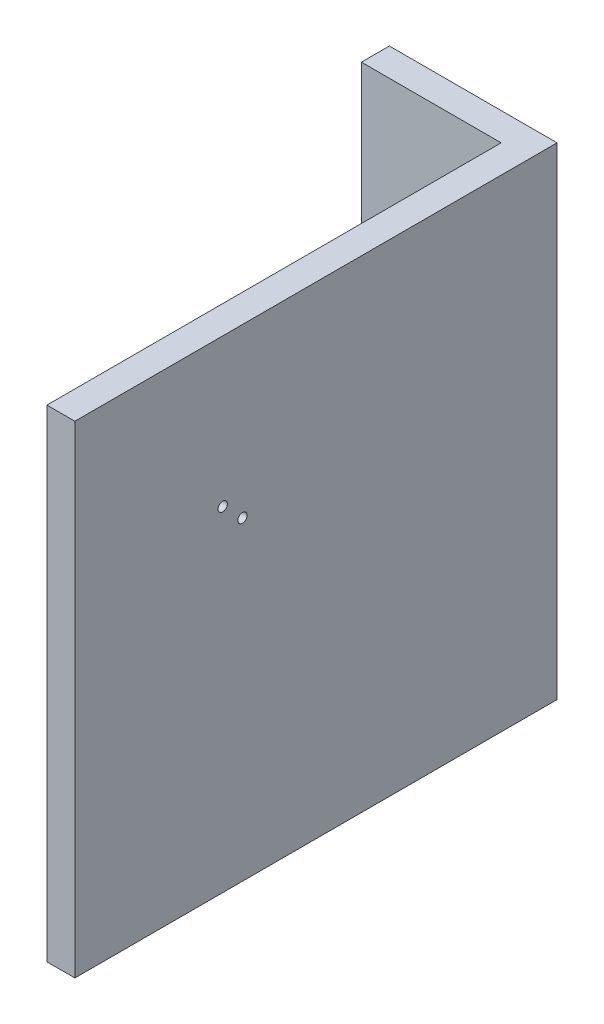
ISO-10303-21;
HEADER;
FILE_DESCRIPTION(('STEP AP214'),'2;1');
FILE_NAME('part.step','',(''),(''),'','','');
FILE_SCHEMA(('AUTOMOTIVE_DESIGN { 1 0 10303 214 1 1 1 1 }'));
ENDSEC;
DATA;
#1=APPLICATION_CONTEXT('core data for automotive mechanical design processes');
#2=APPLICATION_PROTOCOL_DEFINITION('international standard','automotive_design',2000,#1);
#3=PRODUCT_CONTEXT('',#1,'mechanical');
#4=PRODUCT('Part','Part','',(#3));
#5=PRODUCT_RELATED_PRODUCT_CATEGORY('part','',(#4));
#6=PRODUCT_DEFINITION_FORMATION('','',#4);
#7=PRODUCT_DEFINITION_CONTEXT('part definition',#1,'design');
#8=PRODUCT_DEFINITION('design','',#6,#7);
#9=PRODUCT_DEFINITION_SHAPE('','',#8);
#10=(LENGTH_UNIT() NAMED_UNIT(*) SI_UNIT(.MILLI.,.METRE.));
#11=(NAMED_UNIT(*) PLANE_ANGLE_UNIT() SI_UNIT($,.RADIAN.));
#12=(NAMED_UNIT(*) SI_UNIT($,.STERADIAN.) SOLID_ANGLE_UNIT());
#13=UNCERTAINTY_MEASURE_WITH_UNIT(LENGTH_MEASURE(1.E-05),#10,'distance_accuracy_value','');
#14=(GEOMETRIC_REPRESENTATION_CONTEXT(3) GLOBAL_UNCERTAINTY_ASSIGNED_CONTEXT((#13)) GLOBAL_UNIT_ASSIGNED_CONTEXT((#10,
#11,#12)) REPRESENTATION_CONTEXT('',''));
#15=CARTESIAN_POINT('',(0.,0.,0.));
#16=DIRECTION('',(0.,0.,1.));
#17=DIRECTION('',(1.,0.,0.));
#18=AXIS2_PLACEMENT_3D('',#15,#16,#17);
#19=CARTESIAN_POINT('',(-23118.612597115,0.,0.));
#20=DIRECTION('',(1.,0.,0.));
#21=DIRECTION('',(0.,0.,-1.));
#22=AXIS2_PLACEMENT_3D('',#19,#20,#21);
#23=PLANE('',#22);
#24=CARTESIAN_POINT('',(-23118.612597115,6904.39046850381,40831.9938961542));
#25=DIRECTION('',(-1.,0.,0.));
#26=DIRECTION('',(0.,0.,1.));
#27=AXIS2_PLACEMENT_3D('',#24,#25,#26);
#28=CIRCLE('',#27,3.34999999840949);
#29=CARTESIAN_POINT('',(-23118.612597115,6904.39046850381,40835.3438961526));
#30=VERTEX_POINT('',#29);
#31=EDGE_CURVE('E147',#30,#30,#28,.T.);
#32=ORIENTED_EDGE('',*,*,#31,.F.);
#33=EDGE_LOOP('',(#32));
#34=FACE_BOUND('',#33,.T.);
#35=CARTESIAN_POINT('',(-23118.612597115,6918.53260412754,40846.1360317779));
#36=DIRECTION('',(-1.,0.,0.));
#37=DIRECTION('',(0.,0.,1.));
#38=AXIS2_PLACEMENT_3D('',#35,#36,#37);
#39=CIRCLE('',#38,3.34999999840949);
#40=CARTESIAN_POINT('',(-23118.612597115,6918.53260412754,40849.4860317763));
#41=VERTEX_POINT('',#40);
#42=EDGE_CURVE('E104',#41,#41,#39,.T.);
#43=ORIENTED_EDGE('',*,*,#42,.F.);
#44=EDGE_LOOP('',(#43));
#45=FACE_BOUND('',#44,.T.);
#46=DIRECTION('',(0.,1.,0.));
#47=VECTOR('',#46,1.);
#48=CARTESIAN_POINT('',(-23118.612597115,7024.30157612939,40626.9075044839));
#49=LINE('',#48,#47);
#50=CARTESIAN_POINT('',(-23118.612597115,6679.30407683354,40626.9075044839));
#51=VERTEX_POINT('',#50);
#52=CARTESIAN_POINT('',(-23118.612597115,7024.30157612939,40626.9075044839));
#53=VERTEX_POINT('',#52);
#54=EDGE_CURVE('E54',#51,#53,#49,.T.);
#55=ORIENTED_EDGE('',*,*,#54,.F.);
#56=DIRECTION('',(0.,0.,1.));
#57=VECTOR('',#56,1.);
#58=CARTESIAN_POINT('',(-23118.612597115,6679.30407683354,40951.9050037798));
#59=LINE('',#58,#57);
#60=CARTESIAN_POINT('',(-23118.612597115,6679.30407683354,40951.9050037798));
#61=VERTEX_POINT('',#60);
#62=EDGE_CURVE('E59',#51,#61,#59,.T.);
#63=ORIENTED_EDGE('',*,*,#62,.T.);
#64=DIRECTION('',(0.,1.,0.));
#65=VECTOR('',#64,1.);
#66=CARTESIAN_POINT('',(-23118.612597115,7024.30157612939,40951.9050037798));
#67=LINE('',#66,#65);
#68=CARTESIAN_POINT('',(-23118.612597115,7024.30157612939,40951.9050037798));
#69=VERTEX_POINT('',#68);
#70=EDGE_CURVE('E90',#61,#69,#67,.T.);
#71=ORIENTED_EDGE('',*,*,#70,.T.);
#72=DIRECTION('',(0.,0.,-1.));
#73=VECTOR('',#72,1.);
#74=CARTESIAN_POINT('',(-23118.612597115,7024.30157612939,40951.9050037798));
#75=LINE('',#74,#73);
#76=EDGE_CURVE('E152',#69,#53,#75,.T.);
#77=ORIENTED_EDGE('',*,*,#76,.T.);
#78=EDGE_LOOP('',(#55,#63,#71,#77));
#79=FACE_BOUND('',#78,.T.);
#80=ADVANCED_FACE('F39',(#34,#45,#79),#23,.F.);
#81=CARTESIAN_POINT('',(-23118.612597115,7024.30157612939,40951.9050037798));
#82=DIRECTION('',(0.,0.,-1.));
#83=DIRECTION('',(-1.,0.,0.));
#84=AXIS2_PLACEMENT_3D('',#81,#82,#83);
#85=PLANE('',#84);
#86=DIRECTION('',(0.,1.,0.));
#87=VECTOR('',#86,1.);
#88=CARTESIAN_POINT('',(-23098.612597115,7024.30157612939,40951.9050037798));
#89=LINE('',#88,#87);
#90=CARTESIAN_POINT('',(-23098.612597115,6679.30407683354,40951.9050037798));
#91=VERTEX_POINT('',#90);
#92=CARTESIAN_POINT('',(-23098.612597115,7024.30157612939,40951.9050037798));
#93=VERTEX_POINT('',#92);
#94=EDGE_CURVE('E96',#91,#93,#89,.T.);
#95=ORIENTED_EDGE('',*,*,#94,.T.);
#96=DIRECTION('',(1.,0.,0.));
#97=VECTOR('',#96,1.);
#98=CARTESIAN_POINT('',(-23118.612597115,7024.30157612939,40951.9050037798));
#99=LINE('',#98,#97);
#100=EDGE_CURVE('E11',#69,#93,#99,.T.);
#101=ORIENTED_EDGE('',*,*,#100,.F.);
#102=ORIENTED_EDGE('',*,*,#70,.F.);
#103=DIRECTION('',(1.,0.,0.));
#104=VECTOR('',#103,1.);
#105=CARTESIAN_POINT('',(-23118.612597115,6679.30407683354,40951.9050037798));
#106=LINE('',#105,#104);
#107=EDGE_CURVE('E82',#61,#91,#106,.T.);
#108=ORIENTED_EDGE('',*,*,#107,.T.);
#109=EDGE_LOOP('',(#95,#101,#102,#108));
#110=FACE_BOUND('',#109,.T.);
#111=ADVANCED_FACE('F41',(#110),#85,.F.);
#112=CARTESIAN_POINT('',(-23118.612597115,7024.30157612939,40951.9050037798));
#113=DIRECTION('',(0.,-1.,0.));
#114=DIRECTION('',(1.,0.,0.));
#115=AXIS2_PLACEMENT_3D('',#112,#113,#114);
#116=PLANE('',#115);
#117=DIRECTION('',(0.,0.,-1.));
#118=VECTOR('',#117,1.);
#119=CARTESIAN_POINT('',(-23098.612597115,7024.30157612939,40951.9050037798));
#120=LINE('',#119,#118);
#121=CARTESIAN_POINT('',(-23098.612597115,7024.30157612939,40606.9075044839));
#122=VERTEX_POINT('',#121);
#123=EDGE_CURVE('E99',#93,#122,#120,.T.);
#124=ORIENTED_EDGE('',*,*,#123,.T.);
#125=DIRECTION('',(1.,0.,0.));
#126=VECTOR('',#125,1.);
#127=CARTESIAN_POINT('',(-23118.612597115,7024.30157612939,40606.9075044839));
#128=LINE('',#127,#126);
#129=CARTESIAN_POINT('',(-23218.612597115,7024.30157612939,40606.9075044839));
#130=VERTEX_POINT('',#129);
#131=EDGE_CURVE('E47',#130,#122,#128,.T.);
#132=ORIENTED_EDGE('',*,*,#131,.F.);
#133=DIRECTION('',(0.,0.,-1.));
#134=VECTOR('',#133,1.);
#135=CARTESIAN_POINT('',(-23218.612597115,7024.30157612939,40606.9075044839));
#136=LINE('',#135,#134);
#137=CARTESIAN_POINT('',(-23218.612597115,7024.30157612939,40626.9075044839));
#138=VERTEX_POINT('',#137);
#139=EDGE_CURVE('E123',#138,#130,#136,.T.);
#140=ORIENTED_EDGE('',*,*,#139,.F.);
#141=DIRECTION('',(1.,0.,0.));
#142=VECTOR('',#141,1.);
#143=CARTESIAN_POINT('',(-23218.612597115,7024.30157612939,40626.9075044839));
#144=LINE('',#143,#142);
#145=EDGE_CURVE('E133',#138,#53,#144,.T.);
#146=ORIENTED_EDGE('',*,*,#145,.T.);
#147=ORIENTED_EDGE('',*,*,#76,.F.);
#148=ORIENTED_EDGE('',*,*,#100,.T.);
#149=EDGE_LOOP('',(#124,#132,#140,#146,#147,#148));
#150=FACE_BOUND('',#149,.T.);
#151=ADVANCED_FACE('F120',(#150),#116,.F.);
#152=CARTESIAN_POINT('',(-23118.612597115,7024.30157612939,40606.9075044839));
#153=DIRECTION('',(0.,0.,1.));
#154=DIRECTION('',(1.,0.,0.));
#155=AXIS2_PLACEMENT_3D('',#152,#153,#154);
#156=PLANE('',#155);
#157=DIRECTION('',(0.,-1.,0.));
#158=VECTOR('',#157,1.);
#159=CARTESIAN_POINT('',(-23098.612597115,7024.30157612939,40606.9075044839));
#160=LINE('',#159,#158);
#161=CARTESIAN_POINT('',(-23098.612597115,6679.30407683354,40606.9075044839));
#162=VERTEX_POINT('',#161);
#163=EDGE_CURVE('E91',#122,#162,#160,.T.);
#164=ORIENTED_EDGE('',*,*,#163,.T.);
#165=DIRECTION('',(1.,0.,0.));
#166=VECTOR('',#165,1.);
#167=CARTESIAN_POINT('',(-23118.612597115,6679.30407683354,40606.9075044839));
#168=LINE('',#167,#166);
#169=CARTESIAN_POINT('',(-23218.612597115,6679.30407683354,40606.9075044839));
#170=VERTEX_POINT('',#169);
#171=EDGE_CURVE('E86',#170,#162,#168,.T.);
#172=ORIENTED_EDGE('',*,*,#171,.F.);
#173=DIRECTION('',(0.,-1.,0.));
#174=VECTOR('',#173,1.);
#175=CARTESIAN_POINT('',(-23218.612597115,7024.30157612939,40606.9075044839));
#176=LINE('',#175,#174);
#177=EDGE_CURVE('E116',#130,#170,#176,.T.);
#178=ORIENTED_EDGE('',*,*,#177,.F.);
#179=ORIENTED_EDGE('',*,*,#131,.T.);
#180=EDGE_LOOP('',(#164,#172,#178,#179));
#181=FACE_BOUND('',#180,.T.);
#182=ADVANCED_FACE('F114',(#181),#156,.F.);
#183=CARTESIAN_POINT('',(-23118.612597115,6679.30407683354,40951.9050037798));
#184=DIRECTION('',(0.,1.,0.));
#185=DIRECTION('',(-1.,0.,0.));
#186=AXIS2_PLACEMENT_3D('',#183,#184,#185);
#187=PLANE('',#186);
#188=DIRECTION('',(0.,0.,1.));
#189=VECTOR('',#188,1.);
#190=CARTESIAN_POINT('',(-23098.612597115,6679.30407683354,40951.9050037798));
#191=LINE('',#190,#189);
#192=EDGE_CURVE('E79',#162,#91,#191,.T.);
#193=ORIENTED_EDGE('',*,*,#192,.T.);
#194=ORIENTED_EDGE('',*,*,#107,.F.);
#195=ORIENTED_EDGE('',*,*,#62,.F.);
#196=DIRECTION('',(1.,0.,0.));
#197=VECTOR('',#196,1.);
#198=CARTESIAN_POINT('',(-23218.612597115,6679.30407683354,40626.9075044839));
#199=LINE('',#198,#197);
#200=CARTESIAN_POINT('',(-23218.612597115,6679.30407683354,40626.9075044839));
#201=VERTEX_POINT('',#200);
#202=EDGE_CURVE('E135',#201,#51,#199,.T.);
#203=ORIENTED_EDGE('',*,*,#202,.F.);
#204=DIRECTION('',(0.,0.,1.));
#205=VECTOR('',#204,1.);
#206=CARTESIAN_POINT('',(-23218.612597115,6679.30407683354,40606.9075044839));
#207=LINE('',#206,#205);
#208=EDGE_CURVE('E137',#170,#201,#207,.T.);
#209=ORIENTED_EDGE('',*,*,#208,.F.);
#210=ORIENTED_EDGE('',*,*,#171,.T.);
#211=EDGE_LOOP('',(#193,#194,#195,#203,#209,#210));
#212=FACE_BOUND('',#211,.T.);
#213=ADVANCED_FACE('F81',(#212),#187,.F.);
#214=CARTESIAN_POINT('',(-23098.612597115,0.,0.));
#215=DIRECTION('',(1.,0.,0.));
#216=DIRECTION('',(0.,0.,-1.));
#217=AXIS2_PLACEMENT_3D('',#214,#215,#216);
#218=PLANE('',#217);
#219=CARTESIAN_POINT('',(-23098.612597115,6918.53260412754,40846.1360317779));
#220=DIRECTION('',(-1.,0.,0.));
#221=DIRECTION('',(0.,0.,1.));
#222=AXIS2_PLACEMENT_3D('',#219,#220,#221);
#223=CIRCLE('',#222,3.34999999840949);
#224=CARTESIAN_POINT('',(-23098.612597115,6918.53260412754,40849.4860317763));
#225=VERTEX_POINT('',#224);
#226=EDGE_CURVE('E100',#225,#225,#223,.T.);
#227=ORIENTED_EDGE('',*,*,#226,.T.);
#228=EDGE_LOOP('',(#227));
#229=FACE_BOUND('',#228,.T.);
#230=CARTESIAN_POINT('',(-23098.612597115,6904.39046850381,40831.9938961542));
#231=DIRECTION('',(-1.,0.,0.));
#232=DIRECTION('',(0.,0.,1.));
#233=AXIS2_PLACEMENT_3D('',#230,#231,#232);
#234=CIRCLE('',#233,3.34999999840949);
#235=CARTESIAN_POINT('',(-23098.612597115,6904.39046850381,40835.3438961526));
#236=VERTEX_POINT('',#235);
#237=EDGE_CURVE('E143',#236,#236,#234,.T.);
#238=ORIENTED_EDGE('',*,*,#237,.T.);
#239=EDGE_LOOP('',(#238));
#240=FACE_BOUND('',#239,.T.);
#241=ORIENTED_EDGE('',*,*,#94,.F.);
#242=ORIENTED_EDGE('',*,*,#192,.F.);
#243=ORIENTED_EDGE('',*,*,#163,.F.);
#244=ORIENTED_EDGE('',*,*,#123,.F.);
#245=EDGE_LOOP('',(#241,#242,#243,#244));
#246=FACE_BOUND('',#245,.T.);
#247=ADVANCED_FACE('F98',(#229,#240,#246),#218,.T.);
#248=CARTESIAN_POINT('',(-23098.612597115,6904.39046850381,40831.9938961542));
#249=DIRECTION('',(-1.,0.,0.));
#250=DIRECTION('',(0.,0.,1.));
#251=AXIS2_PLACEMENT_3D('',#248,#249,#250);
#252=CYLINDRICAL_SURFACE('',#251,3.34999999840949);
#253=ORIENTED_EDGE('',*,*,#237,.F.);
#254=EDGE_LOOP('',(#253));
#255=FACE_BOUND('',#254,.T.);
#256=ORIENTED_EDGE('',*,*,#31,.T.);
#257=EDGE_LOOP('',(#256));
#258=FACE_BOUND('',#257,.T.);
#259=ADVANCED_FACE('F170',(#255,#258),#252,.F.);
#260=CARTESIAN_POINT('',(-23098.612597115,6918.53260412754,40846.1360317779));
#261=DIRECTION('',(-1.,0.,0.));
#262=DIRECTION('',(0.,0.,1.));
#263=AXIS2_PLACEMENT_3D('',#260,#261,#262);
#264=CYLINDRICAL_SURFACE('',#263,3.34999999840949);
#265=ORIENTED_EDGE('',*,*,#226,.F.);
#266=EDGE_LOOP('',(#265));
#267=FACE_BOUND('',#266,.T.);
#268=ORIENTED_EDGE('',*,*,#42,.T.);
#269=EDGE_LOOP('',(#268));
#270=FACE_BOUND('',#269,.T.);
#271=ADVANCED_FACE('F163',(#267,#270),#264,.F.);
#272=CARTESIAN_POINT('',(-23218.612597115,7024.30157612939,40626.9075044839));
#273=DIRECTION('',(0.,0.,-1.));
#274=DIRECTION('',(-1.,0.,0.));
#275=AXIS2_PLACEMENT_3D('',#272,#273,#274);
#276=PLANE('',#275);
#277=ORIENTED_EDGE('',*,*,#54,.T.);
#278=ORIENTED_EDGE('',*,*,#145,.F.);
#279=DIRECTION('',(0.,1.,0.));
#280=VECTOR('',#279,1.);
#281=CARTESIAN_POINT('',(-23218.612597115,7024.30157612939,40626.9075044839));
#282=LINE('',#281,#280);
#283=EDGE_CURVE('E131',#201,#138,#282,.T.);
#284=ORIENTED_EDGE('',*,*,#283,.F.);
#285=ORIENTED_EDGE('',*,*,#202,.T.);
#286=EDGE_LOOP('',(#277,#278,#284,#285));
#287=FACE_BOUND('',#286,.T.);
#288=ADVANCED_FACE('F155',(#287),#276,.F.);
#289=CARTESIAN_POINT('',(-23218.612597115,0.,0.));
#290=DIRECTION('',(-1.,0.,0.));
#291=DIRECTION('',(0.,0.,1.));
#292=AXIS2_PLACEMENT_3D('',#289,#290,#291);
#293=PLANE('',#292);
#294=ORIENTED_EDGE('',*,*,#177,.T.);
#295=ORIENTED_EDGE('',*,*,#208,.T.);
#296=ORIENTED_EDGE('',*,*,#283,.T.);
#297=ORIENTED_EDGE('',*,*,#139,.T.);
#298=EDGE_LOOP('',(#294,#295,#296,#297));
#299=FACE_BOUND('',#298,.T.);
#300=ADVANCED_FACE('F127',(#299),#293,.T.);
#301=CLOSED_SHELL('',(#80,#111,#151,#182,#213,#247,#259,#271,#288,#300));
#302=MANIFOLD_SOLID_BREP('B2',#301);
#303=ADVANCED_BREP_SHAPE_REPRESENTATION('',(#18,#302),#14);
#304=SHAPE_DEFINITION_REPRESENTATION(#9,#303);
ENDSEC;
END-ISO-10303-21;
